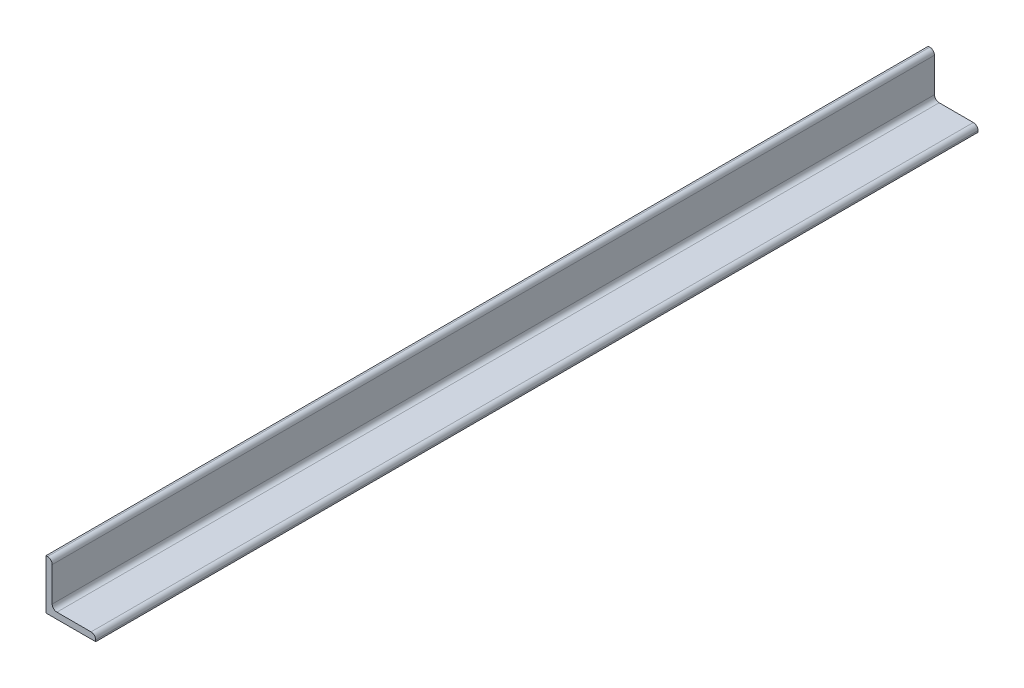
ISO-10303-21;
HEADER;
FILE_DESCRIPTION(('STEP AP214'),'2;1');
FILE_NAME('part.step','',(''),(''),'','','');
FILE_SCHEMA(('AUTOMOTIVE_DESIGN { 1 0 10303 214 1 1 1 1 }'));
ENDSEC;
DATA;
#1=APPLICATION_CONTEXT('core data for automotive mechanical design processes');
#2=APPLICATION_PROTOCOL_DEFINITION('international standard','automotive_design',2000,#1);
#3=PRODUCT_CONTEXT('',#1,'mechanical');
#4=PRODUCT('Part','Part','',(#3));
#5=PRODUCT_RELATED_PRODUCT_CATEGORY('part','',(#4));
#6=PRODUCT_DEFINITION_FORMATION('','',#4);
#7=PRODUCT_DEFINITION_CONTEXT('part definition',#1,'design');
#8=PRODUCT_DEFINITION('design','',#6,#7);
#9=PRODUCT_DEFINITION_SHAPE('','',#8);
#10=(LENGTH_UNIT() NAMED_UNIT(*) SI_UNIT(.MILLI.,.METRE.));
#11=(NAMED_UNIT(*) PLANE_ANGLE_UNIT() SI_UNIT($,.RADIAN.));
#12=(NAMED_UNIT(*) SI_UNIT($,.STERADIAN.) SOLID_ANGLE_UNIT());
#13=UNCERTAINTY_MEASURE_WITH_UNIT(LENGTH_MEASURE(1.E-05),#10,'distance_accuracy_value','');
#14=(GEOMETRIC_REPRESENTATION_CONTEXT(3) GLOBAL_UNCERTAINTY_ASSIGNED_CONTEXT((#13)) GLOBAL_UNIT_ASSIGNED_CONTEXT((#10,
#11,#12)) REPRESENTATION_CONTEXT('',''));
#15=CARTESIAN_POINT('',(0.,0.,0.));
#16=DIRECTION('',(0.,0.,1.));
#17=DIRECTION('',(1.,0.,0.));
#18=AXIS2_PLACEMENT_3D('',#15,#16,#17);
#19=CARTESIAN_POINT('',(50.8,0.,450.85));
#20=DIRECTION('',(0.,1.,0.));
#21=DIRECTION('',(0.,0.,1.));
#22=AXIS2_PLACEMENT_3D('',#19,#20,#21);
#23=PLANE('',#22);
#24=DIRECTION('',(1.,0.,0.));
#25=VECTOR('',#24,1.);
#26=CARTESIAN_POINT('',(50.8,0.,-450.85));
#27=LINE('',#26,#25);
#28=CARTESIAN_POINT('',(0.,0.,-450.85));
#29=VERTEX_POINT('',#28);
#30=CARTESIAN_POINT('',(50.8,0.,-450.85));
#31=VERTEX_POINT('',#30);
#32=EDGE_CURVE('E119',#29,#31,#27,.T.);
#33=ORIENTED_EDGE('',*,*,#32,.T.);
#34=DIRECTION('',(0.,0.,-1.));
#35=VECTOR('',#34,1.);
#36=CARTESIAN_POINT('',(50.8,0.,450.85));
#37=LINE('',#36,#35);
#38=CARTESIAN_POINT('',(50.8,0.,450.85));
#39=VERTEX_POINT('',#38);
#40=EDGE_CURVE('E11',#39,#31,#37,.T.);
#41=ORIENTED_EDGE('',*,*,#40,.F.);
#42=DIRECTION('',(1.,0.,0.));
#43=VECTOR('',#42,1.);
#44=CARTESIAN_POINT('',(50.8,0.,450.85));
#45=LINE('',#44,#43);
#46=CARTESIAN_POINT('',(0.,0.,450.85));
#47=VERTEX_POINT('',#46);
#48=EDGE_CURVE('E135',#47,#39,#45,.T.);
#49=ORIENTED_EDGE('',*,*,#48,.F.);
#50=DIRECTION('',(0.,0.,-1.));
#51=VECTOR('',#50,1.);
#52=CARTESIAN_POINT('',(0.,0.,450.85));
#53=LINE('',#52,#51);
#54=EDGE_CURVE('E115',#47,#29,#53,.T.);
#55=ORIENTED_EDGE('',*,*,#54,.T.);
#56=EDGE_LOOP('',(#33,#41,#49,#55));
#57=FACE_BOUND('',#56,.T.);
#58=ADVANCED_FACE('F17',(#57),#23,.F.);
#59=CARTESIAN_POINT('',(50.8,1.59258,450.85));
#60=DIRECTION('',(-1.,0.,0.));
#61=DIRECTION('',(0.,0.,1.));
#62=AXIS2_PLACEMENT_3D('',#59,#60,#61);
#63=PLANE('',#62);
#64=DIRECTION('',(0.,1.,0.));
#65=VECTOR('',#64,1.);
#66=CARTESIAN_POINT('',(50.8,1.59258,-450.85));
#67=LINE('',#66,#65);
#68=CARTESIAN_POINT('',(50.8,1.59258,-450.85));
#69=VERTEX_POINT('',#68);
#70=EDGE_CURVE('E122',#31,#69,#67,.T.);
#71=ORIENTED_EDGE('',*,*,#70,.T.);
#72=DIRECTION('',(0.,0.,-1.));
#73=VECTOR('',#72,1.);
#74=CARTESIAN_POINT('',(50.8,1.59258,450.85));
#75=LINE('',#74,#73);
#76=CARTESIAN_POINT('',(50.8,1.59258,450.85));
#77=VERTEX_POINT('',#76);
#78=EDGE_CURVE('E25',#77,#69,#75,.T.);
#79=ORIENTED_EDGE('',*,*,#78,.F.);
#80=DIRECTION('',(0.,1.,0.));
#81=VECTOR('',#80,1.);
#82=CARTESIAN_POINT('',(50.8,1.59258,450.85));
#83=LINE('',#82,#81);
#84=EDGE_CURVE('E79',#39,#77,#83,.T.);
#85=ORIENTED_EDGE('',*,*,#84,.F.);
#86=ORIENTED_EDGE('',*,*,#40,.T.);
#87=EDGE_LOOP('',(#71,#79,#85,#86));
#88=FACE_BOUND('',#87,.T.);
#89=ADVANCED_FACE('F178',(#88),#63,.F.);
#90=CARTESIAN_POINT('',(46.04258,1.59258,450.85));
#91=DIRECTION('',(0.,0.,-1.));
#92=DIRECTION('',(-1.,0.,0.));
#93=AXIS2_PLACEMENT_3D('',#90,#91,#92);
#94=CYLINDRICAL_SURFACE('',#93,4.75742);
#95=CARTESIAN_POINT('',(46.04258,1.59258,-450.85));
#96=DIRECTION('',(0.,0.,1.));
#97=DIRECTION('',(1.,0.,0.));
#98=AXIS2_PLACEMENT_3D('',#95,#96,#97);
#99=CIRCLE('',#98,4.75742);
#100=CARTESIAN_POINT('',(46.04258,6.35,-450.85));
#101=VERTEX_POINT('',#100);
#102=EDGE_CURVE('E124',#69,#101,#99,.T.);
#103=ORIENTED_EDGE('',*,*,#102,.T.);
#104=DIRECTION('',(0.,0.,-1.));
#105=VECTOR('',#104,1.);
#106=CARTESIAN_POINT('',(46.04258,6.35,450.85));
#107=LINE('',#106,#105);
#108=CARTESIAN_POINT('',(46.04258,6.35,450.85));
#109=VERTEX_POINT('',#108);
#110=EDGE_CURVE('E145',#109,#101,#107,.T.);
#111=ORIENTED_EDGE('',*,*,#110,.F.);
#112=CARTESIAN_POINT('',(46.04258,1.59258,450.85));
#113=DIRECTION('',(0.,0.,1.));
#114=DIRECTION('',(1.,0.,0.));
#115=AXIS2_PLACEMENT_3D('',#112,#113,#114);
#116=CIRCLE('',#115,4.75742);
#117=EDGE_CURVE('E153',#77,#109,#116,.T.);
#118=ORIENTED_EDGE('',*,*,#117,.F.);
#119=ORIENTED_EDGE('',*,*,#78,.T.);
#120=EDGE_LOOP('',(#103,#111,#118,#119));
#121=FACE_BOUND('',#120,.T.);
#122=ADVANCED_FACE('F151',(#121),#94,.T.);
#123=CARTESIAN_POINT('',(11.1125,6.35,450.85));
#124=DIRECTION('',(0.,-1.,0.));
#125=DIRECTION('',(0.,0.,-1.));
#126=AXIS2_PLACEMENT_3D('',#123,#124,#125);
#127=PLANE('',#126);
#128=DIRECTION('',(-1.,0.,0.));
#129=VECTOR('',#128,1.);
#130=CARTESIAN_POINT('',(11.1125,6.35,-450.85));
#131=LINE('',#130,#129);
#132=CARTESIAN_POINT('',(11.1125,6.35,-450.85));
#133=VERTEX_POINT('',#132);
#134=EDGE_CURVE('E126',#101,#133,#131,.T.);
#135=ORIENTED_EDGE('',*,*,#134,.T.);
#136=DIRECTION('',(0.,0.,-1.));
#137=VECTOR('',#136,1.);
#138=CARTESIAN_POINT('',(11.1125,6.35,450.85));
#139=LINE('',#138,#137);
#140=CARTESIAN_POINT('',(11.1125,6.35,450.85));
#141=VERTEX_POINT('',#140);
#142=EDGE_CURVE('E142',#141,#133,#139,.T.);
#143=ORIENTED_EDGE('',*,*,#142,.F.);
#144=DIRECTION('',(-1.,0.,0.));
#145=VECTOR('',#144,1.);
#146=CARTESIAN_POINT('',(11.1125,6.35,450.85));
#147=LINE('',#146,#145);
#148=EDGE_CURVE('E169',#109,#141,#147,.T.);
#149=ORIENTED_EDGE('',*,*,#148,.F.);
#150=ORIENTED_EDGE('',*,*,#110,.T.);
#151=EDGE_LOOP('',(#135,#143,#149,#150));
#152=FACE_BOUND('',#151,.T.);
#153=ADVANCED_FACE('F162',(#152),#127,.F.);
#154=CARTESIAN_POINT('',(11.1125,11.1125,450.85));
#155=DIRECTION('',(0.,0.,-1.));
#156=DIRECTION('',(-1.,0.,0.));
#157=AXIS2_PLACEMENT_3D('',#154,#155,#156);
#158=CYLINDRICAL_SURFACE('',#157,4.7625);
#159=CARTESIAN_POINT('',(11.1125,11.1125,-450.85));
#160=DIRECTION('',(0.,0.,-1.));
#161=DIRECTION('',(-1.,0.,0.));
#162=AXIS2_PLACEMENT_3D('',#159,#160,#161);
#163=CIRCLE('',#162,4.7625);
#164=CARTESIAN_POINT('',(6.35,11.1125,-450.85));
#165=VERTEX_POINT('',#164);
#166=EDGE_CURVE('E128',#133,#165,#163,.T.);
#167=ORIENTED_EDGE('',*,*,#166,.T.);
#168=DIRECTION('',(0.,0.,-1.));
#169=VECTOR('',#168,1.);
#170=CARTESIAN_POINT('',(6.35,11.1125,450.85));
#171=LINE('',#170,#169);
#172=CARTESIAN_POINT('',(6.35,11.1125,450.85));
#173=VERTEX_POINT('',#172);
#174=EDGE_CURVE('E139',#173,#165,#171,.T.);
#175=ORIENTED_EDGE('',*,*,#174,.F.);
#176=CARTESIAN_POINT('',(11.1125,11.1125,450.85));
#177=DIRECTION('',(0.,0.,-1.));
#178=DIRECTION('',(-1.,0.,0.));
#179=AXIS2_PLACEMENT_3D('',#176,#177,#178);
#180=CIRCLE('',#179,4.7625);
#181=EDGE_CURVE('E168',#141,#173,#180,.T.);
#182=ORIENTED_EDGE('',*,*,#181,.F.);
#183=ORIENTED_EDGE('',*,*,#142,.T.);
#184=EDGE_LOOP('',(#167,#175,#182,#183));
#185=FACE_BOUND('',#184,.T.);
#186=ADVANCED_FACE('F166',(#185),#158,.F.);
#187=CARTESIAN_POINT('',(6.35,46.04258,450.85));
#188=DIRECTION('',(-1.,0.,0.));
#189=DIRECTION('',(0.,-1.,0.));
#190=AXIS2_PLACEMENT_3D('',#187,#188,#189);
#191=PLANE('',#190);
#192=DIRECTION('',(0.,1.,0.));
#193=VECTOR('',#192,1.);
#194=CARTESIAN_POINT('',(6.35,46.04258,-450.85));
#195=LINE('',#194,#193);
#196=CARTESIAN_POINT('',(6.35,46.04258,-450.85));
#197=VERTEX_POINT('',#196);
#198=EDGE_CURVE('E130',#165,#197,#195,.T.);
#199=ORIENTED_EDGE('',*,*,#198,.T.);
#200=DIRECTION('',(0.,0.,-1.));
#201=VECTOR('',#200,1.);
#202=CARTESIAN_POINT('',(6.35,46.04258,450.85));
#203=LINE('',#202,#201);
#204=CARTESIAN_POINT('',(6.35,46.04258,450.85));
#205=VERTEX_POINT('',#204);
#206=EDGE_CURVE('E110',#205,#197,#203,.T.);
#207=ORIENTED_EDGE('',*,*,#206,.F.);
#208=DIRECTION('',(0.,1.,0.));
#209=VECTOR('',#208,1.);
#210=CARTESIAN_POINT('',(6.35,46.04258,450.85));
#211=LINE('',#210,#209);
#212=EDGE_CURVE('E101',#173,#205,#211,.T.);
#213=ORIENTED_EDGE('',*,*,#212,.F.);
#214=ORIENTED_EDGE('',*,*,#174,.T.);
#215=EDGE_LOOP('',(#199,#207,#213,#214));
#216=FACE_BOUND('',#215,.T.);
#217=ADVANCED_FACE('F192',(#216),#191,.F.);
#218=CARTESIAN_POINT('',(1.59258,46.04258,450.85));
#219=DIRECTION('',(0.,0.,-1.));
#220=DIRECTION('',(-1.,0.,0.));
#221=AXIS2_PLACEMENT_3D('',#218,#219,#220);
#222=CYLINDRICAL_SURFACE('',#221,4.75742);
#223=CARTESIAN_POINT('',(1.59258,46.04258,-450.85));
#224=DIRECTION('',(0.,0.,1.));
#225=DIRECTION('',(-1.,0.,0.));
#226=AXIS2_PLACEMENT_3D('',#223,#224,#225);
#227=CIRCLE('',#226,4.75742);
#228=CARTESIAN_POINT('',(1.59258,50.8,-450.85));
#229=VERTEX_POINT('',#228);
#230=EDGE_CURVE('E109',#197,#229,#227,.T.);
#231=ORIENTED_EDGE('',*,*,#230,.T.);
#232=DIRECTION('',(0.,0.,-1.));
#233=VECTOR('',#232,1.);
#234=CARTESIAN_POINT('',(1.59258,50.8,450.85));
#235=LINE('',#234,#233);
#236=CARTESIAN_POINT('',(1.59258,50.8,450.85));
#237=VERTEX_POINT('',#236);
#238=EDGE_CURVE('E106',#237,#229,#235,.T.);
#239=ORIENTED_EDGE('',*,*,#238,.F.);
#240=CARTESIAN_POINT('',(1.59258,46.04258,450.85));
#241=DIRECTION('',(0.,0.,1.));
#242=DIRECTION('',(-1.,0.,0.));
#243=AXIS2_PLACEMENT_3D('',#240,#241,#242);
#244=CIRCLE('',#243,4.75742);
#245=EDGE_CURVE('E95',#205,#237,#244,.T.);
#246=ORIENTED_EDGE('',*,*,#245,.F.);
#247=ORIENTED_EDGE('',*,*,#206,.T.);
#248=EDGE_LOOP('',(#231,#239,#246,#247));
#249=FACE_BOUND('',#248,.T.);
#250=ADVANCED_FACE('F107',(#249),#222,.T.);
#251=CARTESIAN_POINT('',(0.,50.8,450.85));
#252=DIRECTION('',(0.,-1.,0.));
#253=DIRECTION('',(0.,0.,-1.));
#254=AXIS2_PLACEMENT_3D('',#251,#252,#253);
#255=PLANE('',#254);
#256=DIRECTION('',(-1.,0.,0.));
#257=VECTOR('',#256,1.);
#258=CARTESIAN_POINT('',(0.,50.8,-450.85));
#259=LINE('',#258,#257);
#260=CARTESIAN_POINT('',(0.,50.8,-450.85));
#261=VERTEX_POINT('',#260);
#262=EDGE_CURVE('E65',#229,#261,#259,.T.);
#263=ORIENTED_EDGE('',*,*,#262,.T.);
#264=DIRECTION('',(0.,0.,-1.));
#265=VECTOR('',#264,1.);
#266=CARTESIAN_POINT('',(0.,50.8,450.85));
#267=LINE('',#266,#265);
#268=CARTESIAN_POINT('',(0.,50.8,450.85));
#269=VERTEX_POINT('',#268);
#270=EDGE_CURVE('E111',#269,#261,#267,.T.);
#271=ORIENTED_EDGE('',*,*,#270,.F.);
#272=DIRECTION('',(-1.,0.,0.));
#273=VECTOR('',#272,1.);
#274=CARTESIAN_POINT('',(0.,50.8,450.85));
#275=LINE('',#274,#273);
#276=EDGE_CURVE('E99',#237,#269,#275,.T.);
#277=ORIENTED_EDGE('',*,*,#276,.F.);
#278=ORIENTED_EDGE('',*,*,#238,.T.);
#279=EDGE_LOOP('',(#263,#271,#277,#278));
#280=FACE_BOUND('',#279,.T.);
#281=ADVANCED_FACE('F113',(#280),#255,.F.);
#282=CARTESIAN_POINT('',(0.,0.,450.85));
#283=DIRECTION('',(1.,0.,0.));
#284=DIRECTION('',(0.,1.,0.));
#285=AXIS2_PLACEMENT_3D('',#282,#283,#284);
#286=PLANE('',#285);
#287=DIRECTION('',(0.,-1.,0.));
#288=VECTOR('',#287,1.);
#289=CARTESIAN_POINT('',(0.,0.,-450.85));
#290=LINE('',#289,#288);
#291=EDGE_CURVE('E71',#261,#29,#290,.T.);
#292=ORIENTED_EDGE('',*,*,#291,.T.);
#293=ORIENTED_EDGE('',*,*,#54,.F.);
#294=DIRECTION('',(0.,-1.,0.));
#295=VECTOR('',#294,1.);
#296=CARTESIAN_POINT('',(0.,0.,450.85));
#297=LINE('',#296,#295);
#298=EDGE_CURVE('E33',#269,#47,#297,.T.);
#299=ORIENTED_EDGE('',*,*,#298,.F.);
#300=ORIENTED_EDGE('',*,*,#270,.T.);
#301=EDGE_LOOP('',(#292,#293,#299,#300));
#302=FACE_BOUND('',#301,.T.);
#303=ADVANCED_FACE('F200',(#302),#286,.F.);
#304=CARTESIAN_POINT('',(1.59258,46.04258,450.85));
#305=DIRECTION('',(0.,0.,-1.));
#306=DIRECTION('',(-1.,0.,0.));
#307=AXIS2_PLACEMENT_3D('',#304,#305,#306);
#308=PLANE('',#307);
#309=ORIENTED_EDGE('',*,*,#48,.T.);
#310=ORIENTED_EDGE('',*,*,#84,.T.);
#311=ORIENTED_EDGE('',*,*,#117,.T.);
#312=ORIENTED_EDGE('',*,*,#148,.T.);
#313=ORIENTED_EDGE('',*,*,#181,.T.);
#314=ORIENTED_EDGE('',*,*,#212,.T.);
#315=ORIENTED_EDGE('',*,*,#245,.T.);
#316=ORIENTED_EDGE('',*,*,#276,.T.);
#317=ORIENTED_EDGE('',*,*,#298,.T.);
#318=EDGE_LOOP('',(#309,#310,#311,#312,#313,#314,#315,#316,#317));
#319=FACE_BOUND('',#318,.T.);
#320=ADVANCED_FACE('F97',(#319),#308,.F.);
#321=CARTESIAN_POINT('',(1.59258,46.04258,-450.85));
#322=DIRECTION('',(0.,0.,-1.));
#323=DIRECTION('',(-1.,0.,0.));
#324=AXIS2_PLACEMENT_3D('',#321,#322,#323);
#325=PLANE('',#324);
#326=ORIENTED_EDGE('',*,*,#32,.F.);
#327=ORIENTED_EDGE('',*,*,#291,.F.);
#328=ORIENTED_EDGE('',*,*,#262,.F.);
#329=ORIENTED_EDGE('',*,*,#230,.F.);
#330=ORIENTED_EDGE('',*,*,#198,.F.);
#331=ORIENTED_EDGE('',*,*,#166,.F.);
#332=ORIENTED_EDGE('',*,*,#134,.F.);
#333=ORIENTED_EDGE('',*,*,#102,.F.);
#334=ORIENTED_EDGE('',*,*,#70,.F.);
#335=EDGE_LOOP('',(#326,#327,#328,#329,#330,#331,#332,#333,#334));
#336=FACE_BOUND('',#335,.T.);
#337=ADVANCED_FACE('F157',(#336),#325,.T.);
#338=CLOSED_SHELL('',(#58,#89,#122,#153,#186,#217,#250,#281,#303,#320,#337));
#339=MANIFOLD_SOLID_BREP('B1',#338);
#340=ADVANCED_BREP_SHAPE_REPRESENTATION('',(#18,#339),#14);
#341=SHAPE_DEFINITION_REPRESENTATION(#9,#340);
ENDSEC;
END-ISO-10303-21;
